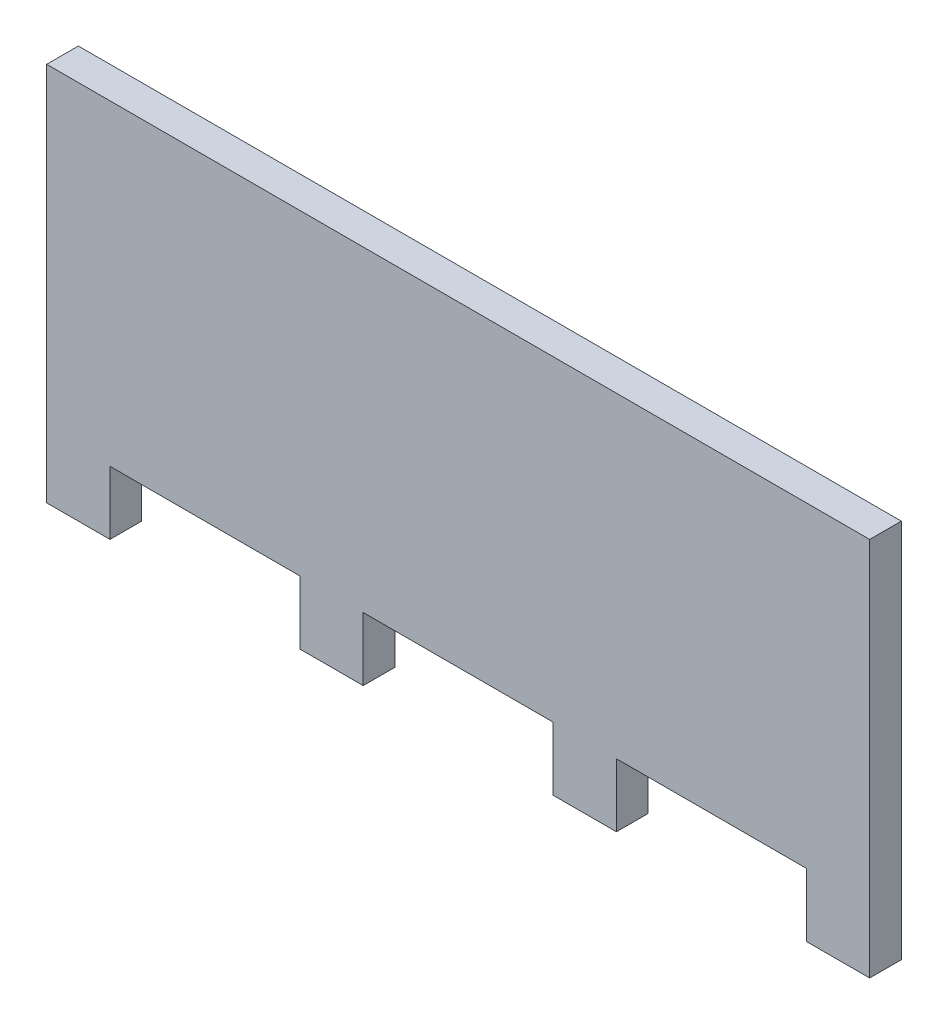
ISO-10303-21;
HEADER;
FILE_DESCRIPTION(('STEP AP214'),'2;1');
FILE_NAME('part.step','',(''),(''),'','','');
FILE_SCHEMA(('AUTOMOTIVE_DESIGN { 1 0 10303 214 1 1 1 1 }'));
ENDSEC;
DATA;
#1=APPLICATION_CONTEXT('core data for automotive mechanical design processes');
#2=APPLICATION_PROTOCOL_DEFINITION('international standard','automotive_design',2000,#1);
#3=PRODUCT_CONTEXT('',#1,'mechanical');
#4=PRODUCT('Part','Part','',(#3));
#5=PRODUCT_RELATED_PRODUCT_CATEGORY('part','',(#4));
#6=PRODUCT_DEFINITION_FORMATION('','',#4);
#7=PRODUCT_DEFINITION_CONTEXT('part definition',#1,'design');
#8=PRODUCT_DEFINITION('design','',#6,#7);
#9=PRODUCT_DEFINITION_SHAPE('','',#8);
#10=(LENGTH_UNIT() NAMED_UNIT(*) SI_UNIT(.MILLI.,.METRE.));
#11=(NAMED_UNIT(*) PLANE_ANGLE_UNIT() SI_UNIT($,.RADIAN.));
#12=(NAMED_UNIT(*) SI_UNIT($,.STERADIAN.) SOLID_ANGLE_UNIT());
#13=UNCERTAINTY_MEASURE_WITH_UNIT(LENGTH_MEASURE(1.E-05),#10,'distance_accuracy_value','');
#14=(GEOMETRIC_REPRESENTATION_CONTEXT(3) GLOBAL_UNCERTAINTY_ASSIGNED_CONTEXT((#13)) GLOBAL_UNIT_ASSIGNED_CONTEXT((#10,
#11,#12)) REPRESENTATION_CONTEXT('',''));
#15=CARTESIAN_POINT('',(0.,0.,0.));
#16=DIRECTION('',(0.,0.,1.));
#17=DIRECTION('',(1.,0.,0.));
#18=AXIS2_PLACEMENT_3D('',#15,#16,#17);
#19=CARTESIAN_POINT('',(-65.,-37.5,5.));
#20=DIRECTION('',(0.,1.,0.));
#21=DIRECTION('',(0.,0.,1.));
#22=AXIS2_PLACEMENT_3D('',#19,#20,#21);
#23=PLANE('',#22);
#24=DIRECTION('',(1.,0.,0.));
#25=VECTOR('',#24,1.);
#26=CARTESIAN_POINT('',(-65.,-37.5,0.));
#27=LINE('',#26,#25);
#28=CARTESIAN_POINT('',(-15.,-37.5,0.));
#29=VERTEX_POINT('',#28);
#30=CARTESIAN_POINT('',(15.,-37.5,0.));
#31=VERTEX_POINT('',#30);
#32=EDGE_CURVE('E260',#29,#31,#27,.T.);
#33=ORIENTED_EDGE('',*,*,#32,.T.);
#34=DIRECTION('',(0.,0.,1.));
#35=VECTOR('',#34,1.);
#36=CARTESIAN_POINT('',(15.,-37.5,0.));
#37=LINE('',#36,#35);
#38=CARTESIAN_POINT('',(15.,-37.5,5.));
#39=VERTEX_POINT('',#38);
#40=EDGE_CURVE('E196',#31,#39,#37,.T.);
#41=ORIENTED_EDGE('',*,*,#40,.T.);
#42=DIRECTION('',(1.,0.,0.));
#43=VECTOR('',#42,1.);
#44=CARTESIAN_POINT('',(-65.,-37.5,5.));
#45=LINE('',#44,#43);
#46=CARTESIAN_POINT('',(-15.,-37.5,5.));
#47=VERTEX_POINT('',#46);
#48=EDGE_CURVE('E264',#47,#39,#45,.T.);
#49=ORIENTED_EDGE('',*,*,#48,.F.);
#50=DIRECTION('',(0.,0.,1.));
#51=VECTOR('',#50,1.);
#52=CARTESIAN_POINT('',(-15.,-37.5,0.));
#53=LINE('',#52,#51);
#54=EDGE_CURVE('E226',#29,#47,#53,.T.);
#55=ORIENTED_EDGE('',*,*,#54,.F.);
#56=EDGE_LOOP('',(#33,#41,#49,#55));
#57=FACE_BOUND('',#56,.T.);
#58=ADVANCED_FACE('F33',(#57),#23,.F.);
#59=CARTESIAN_POINT('',(-55.,-37.5,0.));
#60=VERTEX_POINT('',#59);
#61=CARTESIAN_POINT('',(-25.,-37.5,0.));
#62=VERTEX_POINT('',#61);
#63=EDGE_CURVE('E263',#60,#62,#27,.T.);
#64=ORIENTED_EDGE('',*,*,#63,.T.);
#65=DIRECTION('',(0.,0.,1.));
#66=VECTOR('',#65,1.);
#67=CARTESIAN_POINT('',(-25.,-37.5,0.));
#68=LINE('',#67,#66);
#69=CARTESIAN_POINT('',(-25.,-37.5,5.));
#70=VERTEX_POINT('',#69);
#71=EDGE_CURVE('E223',#62,#70,#68,.T.);
#72=ORIENTED_EDGE('',*,*,#71,.T.);
#73=CARTESIAN_POINT('',(-55.,-37.5,5.));
#74=VERTEX_POINT('',#73);
#75=EDGE_CURVE('E249',#74,#70,#45,.T.);
#76=ORIENTED_EDGE('',*,*,#75,.F.);
#77=DIRECTION('',(0.,0.,1.));
#78=VECTOR('',#77,1.);
#79=CARTESIAN_POINT('',(-55.,-37.5,0.));
#80=LINE('',#79,#78);
#81=EDGE_CURVE('E244',#60,#74,#80,.T.);
#82=ORIENTED_EDGE('',*,*,#81,.F.);
#83=EDGE_LOOP('',(#64,#72,#76,#82));
#84=FACE_BOUND('',#83,.T.);
#85=ADVANCED_FACE('F323',(#84),#23,.F.);
#86=CARTESIAN_POINT('',(25.,-37.5,0.));
#87=VERTEX_POINT('',#86);
#88=CARTESIAN_POINT('',(55.,-37.5,0.));
#89=VERTEX_POINT('',#88);
#90=EDGE_CURVE('E56',#87,#89,#27,.T.);
#91=ORIENTED_EDGE('',*,*,#90,.T.);
#92=DIRECTION('',(0.,0.,1.));
#93=VECTOR('',#92,1.);
#94=CARTESIAN_POINT('',(55.,-37.5,0.));
#95=LINE('',#94,#93);
#96=CARTESIAN_POINT('',(55.,-37.5,5.));
#97=VERTEX_POINT('',#96);
#98=EDGE_CURVE('E51',#89,#97,#95,.T.);
#99=ORIENTED_EDGE('',*,*,#98,.T.);
#100=CARTESIAN_POINT('',(25.,-37.5,5.));
#101=VERTEX_POINT('',#100);
#102=EDGE_CURVE('E37',#101,#97,#45,.T.);
#103=ORIENTED_EDGE('',*,*,#102,.F.);
#104=DIRECTION('',(0.,0.,1.));
#105=VECTOR('',#104,1.);
#106=CARTESIAN_POINT('',(25.,-37.5,0.));
#107=LINE('',#106,#105);
#108=EDGE_CURVE('E199',#87,#101,#107,.T.);
#109=ORIENTED_EDGE('',*,*,#108,.F.);
#110=EDGE_LOOP('',(#91,#99,#103,#109));
#111=FACE_BOUND('',#110,.T.);
#112=ADVANCED_FACE('F321',(#111),#23,.F.);
#113=CARTESIAN_POINT('',(-65.,12.5,5.));
#114=DIRECTION('',(1.,0.,0.));
#115=DIRECTION('',(0.,0.,-1.));
#116=AXIS2_PLACEMENT_3D('',#113,#114,#115);
#117=PLANE('',#116);
#118=DIRECTION('',(0.,-1.,0.));
#119=VECTOR('',#118,1.);
#120=CARTESIAN_POINT('',(-65.,12.5,0.));
#121=LINE('',#120,#119);
#122=CARTESIAN_POINT('',(-65.,12.5,0.));
#123=VERTEX_POINT('',#122);
#124=CARTESIAN_POINT('',(-65.,-47.5,0.));
#125=VERTEX_POINT('',#124);
#126=EDGE_CURVE('E248',#123,#125,#121,.T.);
#127=ORIENTED_EDGE('',*,*,#126,.T.);
#128=DIRECTION('',(0.,0.,1.));
#129=VECTOR('',#128,1.);
#130=CARTESIAN_POINT('',(-65.,-47.5,0.));
#131=LINE('',#130,#129);
#132=CARTESIAN_POINT('',(-65.,-47.5,5.));
#133=VERTEX_POINT('',#132);
#134=EDGE_CURVE('E257',#125,#133,#131,.T.);
#135=ORIENTED_EDGE('',*,*,#134,.T.);
#136=DIRECTION('',(0.,-1.,0.));
#137=VECTOR('',#136,1.);
#138=CARTESIAN_POINT('',(-65.,12.5,5.));
#139=LINE('',#138,#137);
#140=CARTESIAN_POINT('',(-65.,12.5,5.));
#141=VERTEX_POINT('',#140);
#142=EDGE_CURVE('E291',#141,#133,#139,.T.);
#143=ORIENTED_EDGE('',*,*,#142,.F.);
#144=DIRECTION('',(0.,0.,-1.));
#145=VECTOR('',#144,1.);
#146=CARTESIAN_POINT('',(-65.,12.5,5.));
#147=LINE('',#146,#145);
#148=EDGE_CURVE('E43',#141,#123,#147,.T.);
#149=ORIENTED_EDGE('',*,*,#148,.T.);
#150=EDGE_LOOP('',(#127,#135,#143,#149));
#151=FACE_BOUND('',#150,.T.);
#152=ADVANCED_FACE('F35',(#151),#117,.F.);
#153=CARTESIAN_POINT('',(65.,12.5,5.));
#154=DIRECTION('',(-1.,0.,0.));
#155=DIRECTION('',(0.,0.,1.));
#156=AXIS2_PLACEMENT_3D('',#153,#154,#155);
#157=PLANE('',#156);
#158=DIRECTION('',(0.,1.,0.));
#159=VECTOR('',#158,1.);
#160=CARTESIAN_POINT('',(65.,12.5,0.));
#161=LINE('',#160,#159);
#162=CARTESIAN_POINT('',(65.,-47.5,0.));
#163=VERTEX_POINT('',#162);
#164=CARTESIAN_POINT('',(65.,12.5,0.));
#165=VERTEX_POINT('',#164);
#166=EDGE_CURVE('E166',#163,#165,#161,.T.);
#167=ORIENTED_EDGE('',*,*,#166,.T.);
#168=DIRECTION('',(0.,0.,-1.));
#169=VECTOR('',#168,1.);
#170=CARTESIAN_POINT('',(65.,12.5,5.));
#171=LINE('',#170,#169);
#172=CARTESIAN_POINT('',(65.,12.5,5.));
#173=VERTEX_POINT('',#172);
#174=EDGE_CURVE('E11',#173,#165,#171,.T.);
#175=ORIENTED_EDGE('',*,*,#174,.F.);
#176=DIRECTION('',(0.,1.,0.));
#177=VECTOR('',#176,1.);
#178=CARTESIAN_POINT('',(65.,12.5,5.));
#179=LINE('',#178,#177);
#180=CARTESIAN_POINT('',(65.,-47.5,5.));
#181=VERTEX_POINT('',#180);
#182=EDGE_CURVE('E298',#181,#173,#179,.T.);
#183=ORIENTED_EDGE('',*,*,#182,.F.);
#184=DIRECTION('',(0.,0.,1.));
#185=VECTOR('',#184,1.);
#186=CARTESIAN_POINT('',(65.,-47.5,0.));
#187=LINE('',#186,#185);
#188=EDGE_CURVE('E158',#163,#181,#187,.T.);
#189=ORIENTED_EDGE('',*,*,#188,.F.);
#190=EDGE_LOOP('',(#167,#175,#183,#189));
#191=FACE_BOUND('',#190,.T.);
#192=ADVANCED_FACE('F328',(#191),#157,.F.);
#193=CARTESIAN_POINT('',(-65.,12.5,5.));
#194=DIRECTION('',(0.,-1.,0.));
#195=DIRECTION('',(0.,0.,-1.));
#196=AXIS2_PLACEMENT_3D('',#193,#194,#195);
#197=PLANE('',#196);
#198=DIRECTION('',(-1.,0.,0.));
#199=VECTOR('',#198,1.);
#200=CARTESIAN_POINT('',(-65.,12.5,0.));
#201=LINE('',#200,#199);
#202=EDGE_CURVE('E294',#165,#123,#201,.T.);
#203=ORIENTED_EDGE('',*,*,#202,.T.);
#204=ORIENTED_EDGE('',*,*,#148,.F.);
#205=DIRECTION('',(-1.,0.,0.));
#206=VECTOR('',#205,1.);
#207=CARTESIAN_POINT('',(-65.,12.5,5.));
#208=LINE('',#207,#206);
#209=EDGE_CURVE('E293',#173,#141,#208,.T.);
#210=ORIENTED_EDGE('',*,*,#209,.F.);
#211=ORIENTED_EDGE('',*,*,#174,.T.);
#212=EDGE_LOOP('',(#203,#204,#210,#211));
#213=FACE_BOUND('',#212,.T.);
#214=ADVANCED_FACE('F345',(#213),#197,.F.);
#215=CARTESIAN_POINT('',(0.,0.,5.));
#216=DIRECTION('',(0.,0.,1.));
#217=DIRECTION('',(1.,0.,0.));
#218=AXIS2_PLACEMENT_3D('',#215,#216,#217);
#219=PLANE('',#218);
#220=ORIENTED_EDGE('',*,*,#142,.T.);
#221=DIRECTION('',(1.,0.,0.));
#222=VECTOR('',#221,1.);
#223=CARTESIAN_POINT('',(-65.,-47.5,5.));
#224=LINE('',#223,#222);
#225=CARTESIAN_POINT('',(-55.,-47.5,5.));
#226=VERTEX_POINT('',#225);
#227=EDGE_CURVE('E225',#133,#226,#224,.T.);
#228=ORIENTED_EDGE('',*,*,#227,.T.);
#229=DIRECTION('',(0.,1.,0.));
#230=VECTOR('',#229,1.);
#231=CARTESIAN_POINT('',(-55.,-37.5,5.));
#232=LINE('',#231,#230);
#233=EDGE_CURVE('E236',#226,#74,#232,.T.);
#234=ORIENTED_EDGE('',*,*,#233,.T.);
#235=ORIENTED_EDGE('',*,*,#75,.T.);
#236=DIRECTION('',(0.,-1.,0.));
#237=VECTOR('',#236,1.);
#238=CARTESIAN_POINT('',(-25.,-37.5,5.));
#239=LINE('',#238,#237);
#240=CARTESIAN_POINT('',(-25.,-47.5,5.));
#241=VERTEX_POINT('',#240);
#242=EDGE_CURVE('E198',#70,#241,#239,.T.);
#243=ORIENTED_EDGE('',*,*,#242,.T.);
#244=DIRECTION('',(1.,0.,0.));
#245=VECTOR('',#244,1.);
#246=CARTESIAN_POINT('',(-25.,-47.5,5.));
#247=LINE('',#246,#245);
#248=CARTESIAN_POINT('',(-15.,-47.5,5.));
#249=VERTEX_POINT('',#248);
#250=EDGE_CURVE('E218',#241,#249,#247,.T.);
#251=ORIENTED_EDGE('',*,*,#250,.T.);
#252=DIRECTION('',(0.,1.,0.));
#253=VECTOR('',#252,1.);
#254=CARTESIAN_POINT('',(-15.,-37.5,5.));
#255=LINE('',#254,#253);
#256=EDGE_CURVE('E209',#249,#47,#255,.T.);
#257=ORIENTED_EDGE('',*,*,#256,.T.);
#258=ORIENTED_EDGE('',*,*,#48,.T.);
#259=DIRECTION('',(0.,-1.,0.));
#260=VECTOR('',#259,1.);
#261=CARTESIAN_POINT('',(15.,-37.5,5.));
#262=LINE('',#261,#260);
#263=CARTESIAN_POINT('',(15.,-47.5,5.));
#264=VERTEX_POINT('',#263);
#265=EDGE_CURVE('E176',#39,#264,#262,.T.);
#266=ORIENTED_EDGE('',*,*,#265,.T.);
#267=DIRECTION('',(1.,0.,0.));
#268=VECTOR('',#267,1.);
#269=CARTESIAN_POINT('',(15.,-47.5,5.));
#270=LINE('',#269,#268);
#271=CARTESIAN_POINT('',(25.,-47.5,5.));
#272=VERTEX_POINT('',#271);
#273=EDGE_CURVE('E191',#264,#272,#270,.T.);
#274=ORIENTED_EDGE('',*,*,#273,.T.);
#275=DIRECTION('',(0.,1.,0.));
#276=VECTOR('',#275,1.);
#277=CARTESIAN_POINT('',(25.,-37.5,5.));
#278=LINE('',#277,#276);
#279=EDGE_CURVE('E182',#272,#101,#278,.T.);
#280=ORIENTED_EDGE('',*,*,#279,.T.);
#281=ORIENTED_EDGE('',*,*,#102,.T.);
#282=DIRECTION('',(0.,-1.,0.));
#283=VECTOR('',#282,1.);
#284=CARTESIAN_POINT('',(55.,-37.5,5.));
#285=LINE('',#284,#283);
#286=CARTESIAN_POINT('',(55.,-47.5,5.));
#287=VERTEX_POINT('',#286);
#288=EDGE_CURVE('E171',#97,#287,#285,.T.);
#289=ORIENTED_EDGE('',*,*,#288,.T.);
#290=DIRECTION('',(1.,0.,0.));
#291=VECTOR('',#290,1.);
#292=CARTESIAN_POINT('',(55.,-47.5,5.));
#293=LINE('',#292,#291);
#294=EDGE_CURVE('E153',#287,#181,#293,.T.);
#295=ORIENTED_EDGE('',*,*,#294,.T.);
#296=ORIENTED_EDGE('',*,*,#182,.T.);
#297=ORIENTED_EDGE('',*,*,#209,.T.);
#298=EDGE_LOOP('',(#220,#228,#234,#235,#243,#251,#257,#258,#266,#274,#280,#281,#289,#295,#296,#297));
#299=FACE_BOUND('',#298,.T.);
#300=ADVANCED_FACE('F290',(#299),#219,.T.);
#301=CARTESIAN_POINT('',(0.,0.,0.));
#302=DIRECTION('',(0.,0.,1.));
#303=DIRECTION('',(1.,0.,0.));
#304=AXIS2_PLACEMENT_3D('',#301,#302,#303);
#305=PLANE('',#304);
#306=ORIENTED_EDGE('',*,*,#126,.F.);
#307=ORIENTED_EDGE('',*,*,#202,.F.);
#308=ORIENTED_EDGE('',*,*,#166,.F.);
#309=DIRECTION('',(1.,0.,0.));
#310=VECTOR('',#309,1.);
#311=CARTESIAN_POINT('',(55.,-47.5,0.));
#312=LINE('',#311,#310);
#313=CARTESIAN_POINT('',(55.,-47.5,0.));
#314=VERTEX_POINT('',#313);
#315=EDGE_CURVE('E151',#314,#163,#312,.T.);
#316=ORIENTED_EDGE('',*,*,#315,.F.);
#317=DIRECTION('',(0.,-1.,0.));
#318=VECTOR('',#317,1.);
#319=CARTESIAN_POINT('',(55.,-37.5,0.));
#320=LINE('',#319,#318);
#321=EDGE_CURVE('E164',#89,#314,#320,.T.);
#322=ORIENTED_EDGE('',*,*,#321,.F.);
#323=ORIENTED_EDGE('',*,*,#90,.F.);
#324=DIRECTION('',(0.,1.,0.));
#325=VECTOR('',#324,1.);
#326=CARTESIAN_POINT('',(25.,-37.5,0.));
#327=LINE('',#326,#325);
#328=CARTESIAN_POINT('',(25.,-47.5,0.));
#329=VERTEX_POINT('',#328);
#330=EDGE_CURVE('E185',#329,#87,#327,.T.);
#331=ORIENTED_EDGE('',*,*,#330,.F.);
#332=DIRECTION('',(1.,0.,0.));
#333=VECTOR('',#332,1.);
#334=CARTESIAN_POINT('',(15.,-47.5,0.));
#335=LINE('',#334,#333);
#336=CARTESIAN_POINT('',(15.,-47.5,0.));
#337=VERTEX_POINT('',#336);
#338=EDGE_CURVE('E181',#337,#329,#335,.T.);
#339=ORIENTED_EDGE('',*,*,#338,.F.);
#340=DIRECTION('',(0.,-1.,0.));
#341=VECTOR('',#340,1.);
#342=CARTESIAN_POINT('',(15.,-37.5,0.));
#343=LINE('',#342,#341);
#344=EDGE_CURVE('E178',#31,#337,#343,.T.);
#345=ORIENTED_EDGE('',*,*,#344,.F.);
#346=ORIENTED_EDGE('',*,*,#32,.F.);
#347=DIRECTION('',(0.,1.,0.));
#348=VECTOR('',#347,1.);
#349=CARTESIAN_POINT('',(-15.,-37.5,0.));
#350=LINE('',#349,#348);
#351=CARTESIAN_POINT('',(-15.,-47.5,0.));
#352=VERTEX_POINT('',#351);
#353=EDGE_CURVE('E212',#352,#29,#350,.T.);
#354=ORIENTED_EDGE('',*,*,#353,.F.);
#355=DIRECTION('',(1.,0.,0.));
#356=VECTOR('',#355,1.);
#357=CARTESIAN_POINT('',(-25.,-47.5,0.));
#358=LINE('',#357,#356);
#359=CARTESIAN_POINT('',(-25.,-47.5,0.));
#360=VERTEX_POINT('',#359);
#361=EDGE_CURVE('E208',#360,#352,#358,.T.);
#362=ORIENTED_EDGE('',*,*,#361,.F.);
#363=DIRECTION('',(0.,-1.,0.));
#364=VECTOR('',#363,1.);
#365=CARTESIAN_POINT('',(-25.,-37.5,0.));
#366=LINE('',#365,#364);
#367=EDGE_CURVE('E205',#62,#360,#366,.T.);
#368=ORIENTED_EDGE('',*,*,#367,.F.);
#369=ORIENTED_EDGE('',*,*,#63,.F.);
#370=DIRECTION('',(0.,1.,0.));
#371=VECTOR('',#370,1.);
#372=CARTESIAN_POINT('',(-55.,-37.5,0.));
#373=LINE('',#372,#371);
#374=CARTESIAN_POINT('',(-55.,-47.5,0.));
#375=VERTEX_POINT('',#374);
#376=EDGE_CURVE('E235',#375,#60,#373,.T.);
#377=ORIENTED_EDGE('',*,*,#376,.F.);
#378=DIRECTION('',(1.,0.,0.));
#379=VECTOR('',#378,1.);
#380=CARTESIAN_POINT('',(-65.,-47.5,0.));
#381=LINE('',#380,#379);
#382=EDGE_CURVE('E232',#125,#375,#381,.T.);
#383=ORIENTED_EDGE('',*,*,#382,.F.);
#384=EDGE_LOOP('',(#306,#307,#308,#316,#322,#323,#331,#339,#345,#346,#354,#362,#368,#369,#377,#383));
#385=FACE_BOUND('',#384,.T.);
#386=ADVANCED_FACE('F163',(#385),#305,.F.);
#387=CARTESIAN_POINT('',(-55.,-37.5,0.));
#388=DIRECTION('',(1.,0.,0.));
#389=DIRECTION('',(0.,0.,-1.));
#390=AXIS2_PLACEMENT_3D('',#387,#388,#389);
#391=PLANE('',#390);
#392=ORIENTED_EDGE('',*,*,#233,.F.);
#393=DIRECTION('',(0.,0.,1.));
#394=VECTOR('',#393,1.);
#395=CARTESIAN_POINT('',(-55.,-47.5,0.));
#396=LINE('',#395,#394);
#397=EDGE_CURVE('E241',#375,#226,#396,.T.);
#398=ORIENTED_EDGE('',*,*,#397,.F.);
#399=ORIENTED_EDGE('',*,*,#376,.T.);
#400=ORIENTED_EDGE('',*,*,#81,.T.);
#401=EDGE_LOOP('',(#392,#398,#399,#400));
#402=FACE_BOUND('',#401,.T.);
#403=ADVANCED_FACE('F287',(#402),#391,.T.);
#404=CARTESIAN_POINT('',(-65.,-47.5,0.));
#405=DIRECTION('',(0.,-1.,0.));
#406=DIRECTION('',(0.,0.,-1.));
#407=AXIS2_PLACEMENT_3D('',#404,#405,#406);
#408=PLANE('',#407);
#409=ORIENTED_EDGE('',*,*,#227,.F.);
#410=ORIENTED_EDGE('',*,*,#134,.F.);
#411=ORIENTED_EDGE('',*,*,#382,.T.);
#412=ORIENTED_EDGE('',*,*,#397,.T.);
#413=EDGE_LOOP('',(#409,#410,#411,#412));
#414=FACE_BOUND('',#413,.T.);
#415=ADVANCED_FACE('F281',(#414),#408,.T.);
#416=CARTESIAN_POINT('',(-25.,-37.5,0.));
#417=DIRECTION('',(-1.,0.,0.));
#418=DIRECTION('',(0.,0.,1.));
#419=AXIS2_PLACEMENT_3D('',#416,#417,#418);
#420=PLANE('',#419);
#421=ORIENTED_EDGE('',*,*,#242,.F.);
#422=ORIENTED_EDGE('',*,*,#71,.F.);
#423=ORIENTED_EDGE('',*,*,#367,.T.);
#424=DIRECTION('',(0.,0.,1.));
#425=VECTOR('',#424,1.);
#426=CARTESIAN_POINT('',(-25.,-47.5,0.));
#427=LINE('',#426,#425);
#428=EDGE_CURVE('E215',#360,#241,#427,.T.);
#429=ORIENTED_EDGE('',*,*,#428,.T.);
#430=EDGE_LOOP('',(#421,#422,#423,#429));
#431=FACE_BOUND('',#430,.T.);
#432=ADVANCED_FACE('F341',(#431),#420,.T.);
#433=CARTESIAN_POINT('',(-15.,-37.5,0.));
#434=DIRECTION('',(1.,0.,0.));
#435=DIRECTION('',(0.,0.,-1.));
#436=AXIS2_PLACEMENT_3D('',#433,#434,#435);
#437=PLANE('',#436);
#438=ORIENTED_EDGE('',*,*,#256,.F.);
#439=DIRECTION('',(0.,0.,1.));
#440=VECTOR('',#439,1.);
#441=CARTESIAN_POINT('',(-15.,-47.5,0.));
#442=LINE('',#441,#440);
#443=EDGE_CURVE('E229',#352,#249,#442,.T.);
#444=ORIENTED_EDGE('',*,*,#443,.F.);
#445=ORIENTED_EDGE('',*,*,#353,.T.);
#446=ORIENTED_EDGE('',*,*,#54,.T.);
#447=EDGE_LOOP('',(#438,#444,#445,#446));
#448=FACE_BOUND('',#447,.T.);
#449=ADVANCED_FACE('F362',(#448),#437,.T.);
#450=CARTESIAN_POINT('',(-25.,-47.5,0.));
#451=DIRECTION('',(0.,-1.,0.));
#452=DIRECTION('',(0.,0.,-1.));
#453=AXIS2_PLACEMENT_3D('',#450,#451,#452);
#454=PLANE('',#453);
#455=ORIENTED_EDGE('',*,*,#250,.F.);
#456=ORIENTED_EDGE('',*,*,#428,.F.);
#457=ORIENTED_EDGE('',*,*,#361,.T.);
#458=ORIENTED_EDGE('',*,*,#443,.T.);
#459=EDGE_LOOP('',(#455,#456,#457,#458));
#460=FACE_BOUND('',#459,.T.);
#461=ADVANCED_FACE('F339',(#460),#454,.T.);
#462=CARTESIAN_POINT('',(15.,-37.5,0.));
#463=DIRECTION('',(-1.,0.,0.));
#464=DIRECTION('',(0.,0.,1.));
#465=AXIS2_PLACEMENT_3D('',#462,#463,#464);
#466=PLANE('',#465);
#467=ORIENTED_EDGE('',*,*,#265,.F.);
#468=ORIENTED_EDGE('',*,*,#40,.F.);
#469=ORIENTED_EDGE('',*,*,#344,.T.);
#470=DIRECTION('',(0.,0.,1.));
#471=VECTOR('',#470,1.);
#472=CARTESIAN_POINT('',(15.,-47.5,0.));
#473=LINE('',#472,#471);
#474=EDGE_CURVE('E188',#337,#264,#473,.T.);
#475=ORIENTED_EDGE('',*,*,#474,.T.);
#476=EDGE_LOOP('',(#467,#468,#469,#475));
#477=FACE_BOUND('',#476,.T.);
#478=ADVANCED_FACE('F311',(#477),#466,.T.);
#479=CARTESIAN_POINT('',(25.,-37.5,0.));
#480=DIRECTION('',(1.,0.,0.));
#481=DIRECTION('',(0.,0.,-1.));
#482=AXIS2_PLACEMENT_3D('',#479,#480,#481);
#483=PLANE('',#482);
#484=ORIENTED_EDGE('',*,*,#279,.F.);
#485=DIRECTION('',(0.,0.,1.));
#486=VECTOR('',#485,1.);
#487=CARTESIAN_POINT('',(25.,-47.5,0.));
#488=LINE('',#487,#486);
#489=EDGE_CURVE('E202',#329,#272,#488,.T.);
#490=ORIENTED_EDGE('',*,*,#489,.F.);
#491=ORIENTED_EDGE('',*,*,#330,.T.);
#492=ORIENTED_EDGE('',*,*,#108,.T.);
#493=EDGE_LOOP('',(#484,#490,#491,#492));
#494=FACE_BOUND('',#493,.T.);
#495=ADVANCED_FACE('F319',(#494),#483,.T.);
#496=CARTESIAN_POINT('',(15.,-47.5,0.));
#497=DIRECTION('',(0.,-1.,0.));
#498=DIRECTION('',(0.,0.,-1.));
#499=AXIS2_PLACEMENT_3D('',#496,#497,#498);
#500=PLANE('',#499);
#501=ORIENTED_EDGE('',*,*,#273,.F.);
#502=ORIENTED_EDGE('',*,*,#474,.F.);
#503=ORIENTED_EDGE('',*,*,#338,.T.);
#504=ORIENTED_EDGE('',*,*,#489,.T.);
#505=EDGE_LOOP('',(#501,#502,#503,#504));
#506=FACE_BOUND('',#505,.T.);
#507=ADVANCED_FACE('F316',(#506),#500,.T.);
#508=CARTESIAN_POINT('',(55.,-37.5,0.));
#509=DIRECTION('',(-1.,0.,0.));
#510=DIRECTION('',(0.,0.,1.));
#511=AXIS2_PLACEMENT_3D('',#508,#509,#510);
#512=PLANE('',#511);
#513=ORIENTED_EDGE('',*,*,#288,.F.);
#514=ORIENTED_EDGE('',*,*,#98,.F.);
#515=ORIENTED_EDGE('',*,*,#321,.T.);
#516=DIRECTION('',(0.,0.,1.));
#517=VECTOR('',#516,1.);
#518=CARTESIAN_POINT('',(55.,-47.5,0.));
#519=LINE('',#518,#517);
#520=EDGE_CURVE('E147',#314,#287,#519,.T.);
#521=ORIENTED_EDGE('',*,*,#520,.T.);
#522=EDGE_LOOP('',(#513,#514,#515,#521));
#523=FACE_BOUND('',#522,.T.);
#524=ADVANCED_FACE('F169',(#523),#512,.T.);
#525=CARTESIAN_POINT('',(55.,-47.5,0.));
#526=DIRECTION('',(0.,-1.,0.));
#527=DIRECTION('',(0.,0.,-1.));
#528=AXIS2_PLACEMENT_3D('',#525,#526,#527);
#529=PLANE('',#528);
#530=ORIENTED_EDGE('',*,*,#294,.F.);
#531=ORIENTED_EDGE('',*,*,#520,.F.);
#532=ORIENTED_EDGE('',*,*,#315,.T.);
#533=ORIENTED_EDGE('',*,*,#188,.T.);
#534=EDGE_LOOP('',(#530,#531,#532,#533));
#535=FACE_BOUND('',#534,.T.);
#536=ADVANCED_FACE('F149',(#535),#529,.T.);
#537=CLOSED_SHELL('',(#58,#85,#112,#152,#192,#214,#300,#386,#403,#415,#432,#449,#461,#478,#495,
#507,#524,#536));
#538=MANIFOLD_SOLID_BREP('B2',#537);
#539=ADVANCED_BREP_SHAPE_REPRESENTATION('',(#18,#538),#14);
#540=SHAPE_DEFINITION_REPRESENTATION(#9,#539);
ENDSEC;
END-ISO-10303-21;
